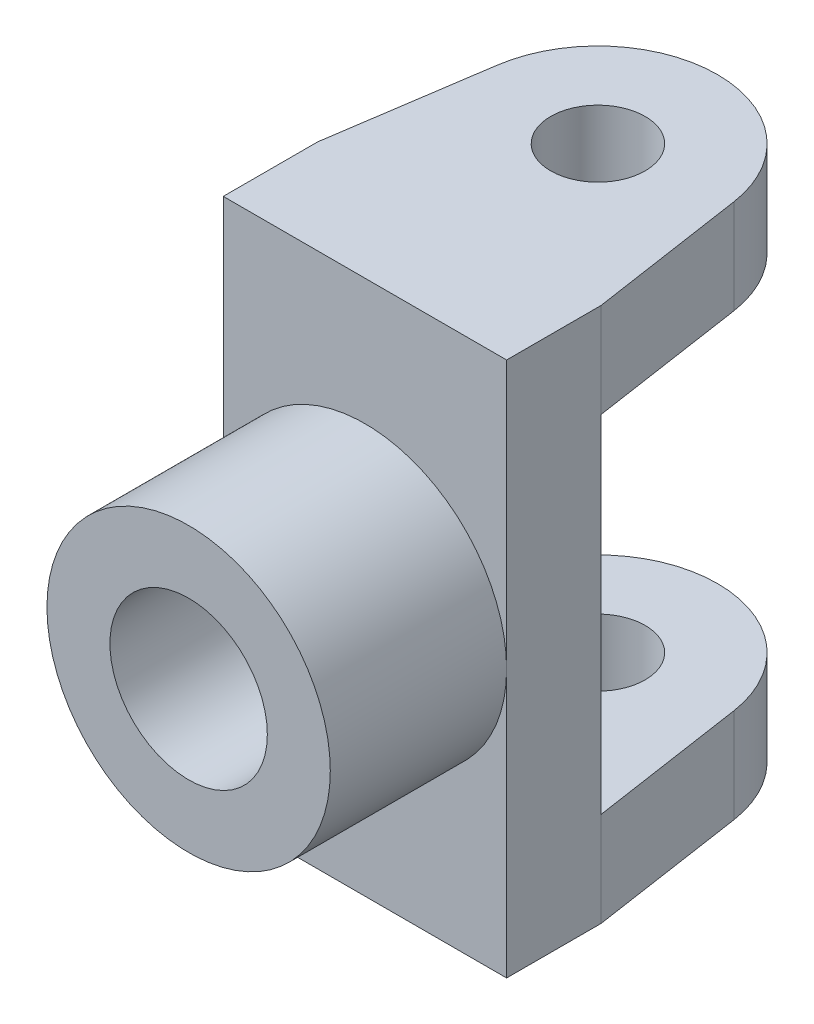
ISO-10303-21;
HEADER;
FILE_DESCRIPTION(('STEP AP214'),'2;1');
FILE_NAME('part.step','',(''),(''),'','','');
FILE_SCHEMA(('AUTOMOTIVE_DESIGN { 1 0 10303 214 1 1 1 1 }'));
ENDSEC;
DATA;
#1=APPLICATION_CONTEXT('core data for automotive mechanical design processes');
#2=APPLICATION_PROTOCOL_DEFINITION('international standard','automotive_design',2000,#1);
#3=PRODUCT_CONTEXT('',#1,'mechanical');
#4=PRODUCT('Part','Part','',(#3));
#5=PRODUCT_RELATED_PRODUCT_CATEGORY('part','',(#4));
#6=PRODUCT_DEFINITION_FORMATION('','',#4);
#7=PRODUCT_DEFINITION_CONTEXT('part definition',#1,'design');
#8=PRODUCT_DEFINITION('design','',#6,#7);
#9=PRODUCT_DEFINITION_SHAPE('','',#8);
#10=(LENGTH_UNIT() NAMED_UNIT(*) SI_UNIT(.MILLI.,.METRE.));
#11=(NAMED_UNIT(*) PLANE_ANGLE_UNIT() SI_UNIT($,.RADIAN.));
#12=(NAMED_UNIT(*) SI_UNIT($,.STERADIAN.) SOLID_ANGLE_UNIT());
#13=UNCERTAINTY_MEASURE_WITH_UNIT(LENGTH_MEASURE(1.E-05),#10,'distance_accuracy_value','');
#14=(GEOMETRIC_REPRESENTATION_CONTEXT(3) GLOBAL_UNCERTAINTY_ASSIGNED_CONTEXT((#13)) GLOBAL_UNIT_ASSIGNED_CONTEXT((#10,
#11,#12)) REPRESENTATION_CONTEXT('',''));
#15=CARTESIAN_POINT('',(0.,0.,0.));
#16=DIRECTION('',(0.,0.,1.));
#17=DIRECTION('',(1.,0.,0.));
#18=AXIS2_PLACEMENT_3D('',#15,#16,#17);
#19=CARTESIAN_POINT('',(0.,0.,0.));
#20=DIRECTION('',(0.,0.,1.));
#21=DIRECTION('',(1.,0.,0.));
#22=AXIS2_PLACEMENT_3D('',#19,#20,#21);
#23=PLANE('',#22);
#24=DIRECTION('',(-1.,0.,0.));
#25=VECTOR('',#24,1.);
#26=CARTESIAN_POINT('',(0.,-55.,0.));
#27=LINE('',#26,#25);
#28=CARTESIAN_POINT('',(45.,-55.,0.));
#29=VERTEX_POINT('',#28);
#30=CARTESIAN_POINT('',(-45.,-55.,0.));
#31=VERTEX_POINT('',#30);
#32=EDGE_CURVE('E137',#29,#31,#27,.T.);
#33=ORIENTED_EDGE('',*,*,#32,.T.);
#34=DIRECTION('',(0.,-1.,0.));
#35=VECTOR('',#34,1.);
#36=CARTESIAN_POINT('',(-45.,85.,0.));
#37=LINE('',#36,#35);
#38=CARTESIAN_POINT('',(-45.,55.,0.));
#39=VERTEX_POINT('',#38);
#40=EDGE_CURVE('E160',#39,#31,#37,.T.);
#41=ORIENTED_EDGE('',*,*,#40,.F.);
#42=DIRECTION('',(-1.,0.,0.));
#43=VECTOR('',#42,1.);
#44=CARTESIAN_POINT('',(0.,55.,0.));
#45=LINE('',#44,#43);
#46=CARTESIAN_POINT('',(45.,55.,0.));
#47=VERTEX_POINT('',#46);
#48=EDGE_CURVE('E151',#47,#39,#45,.T.);
#49=ORIENTED_EDGE('',*,*,#48,.F.);
#50=DIRECTION('',(0.,1.,0.));
#51=VECTOR('',#50,1.);
#52=CARTESIAN_POINT('',(45.,85.,0.));
#53=LINE('',#52,#51);
#54=EDGE_CURVE('E59',#29,#47,#53,.T.);
#55=ORIENTED_EDGE('',*,*,#54,.F.);
#56=EDGE_LOOP('',(#33,#41,#49,#55));
#57=FACE_BOUND('',#56,.T.);
#58=ADVANCED_FACE('F41',(#57),#23,.F.);
#59=CARTESIAN_POINT('',(0.,0.,30.));
#60=DIRECTION('',(0.,0.,1.));
#61=DIRECTION('',(1.,0.,0.));
#62=AXIS2_PLACEMENT_3D('',#59,#60,#61);
#63=PLANE('',#62);
#64=CARTESIAN_POINT('',(0.,0.,30.));
#65=DIRECTION('',(0.,0.,1.));
#66=DIRECTION('',(1.,0.,0.));
#67=AXIS2_PLACEMENT_3D('',#64,#65,#66);
#68=CIRCLE('',#67,45.);
#69=CARTESIAN_POINT('',(45.,0.,30.));
#70=VERTEX_POINT('',#69);
#71=CARTESIAN_POINT('',(-45.,0.,30.));
#72=VERTEX_POINT('',#71);
#73=EDGE_CURVE('E52',#70,#72,#68,.T.);
#74=ORIENTED_EDGE('',*,*,#73,.F.);
#75=DIRECTION('',(0.,1.,0.));
#76=VECTOR('',#75,1.);
#77=CARTESIAN_POINT('',(45.,85.,30.));
#78=LINE('',#77,#76);
#79=CARTESIAN_POINT('',(45.,85.,30.));
#80=VERTEX_POINT('',#79);
#81=EDGE_CURVE('E169',#70,#80,#78,.T.);
#82=ORIENTED_EDGE('',*,*,#81,.T.);
#83=DIRECTION('',(-1.,0.,0.));
#84=VECTOR('',#83,1.);
#85=CARTESIAN_POINT('',(-45.,85.,30.));
#86=LINE('',#85,#84);
#87=CARTESIAN_POINT('',(-45.,85.,30.));
#88=VERTEX_POINT('',#87);
#89=EDGE_CURVE('E192',#80,#88,#86,.T.);
#90=ORIENTED_EDGE('',*,*,#89,.T.);
#91=DIRECTION('',(0.,-1.,0.));
#92=VECTOR('',#91,1.);
#93=CARTESIAN_POINT('',(-45.,85.,30.));
#94=LINE('',#93,#92);
#95=EDGE_CURVE('E242',#88,#72,#94,.T.);
#96=ORIENTED_EDGE('',*,*,#95,.T.);
#97=EDGE_LOOP('',(#74,#82,#90,#96));
#98=FACE_BOUND('',#97,.T.);
#99=ADVANCED_FACE('F261',(#98),#63,.T.);
#100=CARTESIAN_POINT('',(45.,85.,30.));
#101=DIRECTION('',(-1.,0.,0.));
#102=DIRECTION('',(0.,-1.,0.));
#103=AXIS2_PLACEMENT_3D('',#100,#101,#102);
#104=PLANE('',#103);
#105=CARTESIAN_POINT('',(45.,-85.,0.));
#106=VERTEX_POINT('',#105);
#107=EDGE_CURVE('E131',#106,#29,#53,.T.);
#108=ORIENTED_EDGE('',*,*,#107,.T.);
#109=ORIENTED_EDGE('',*,*,#54,.T.);
#110=DIRECTION('',(0.,1.,0.));
#111=VECTOR('',#110,1.);
#112=CARTESIAN_POINT('',(45.,55.,0.));
#113=LINE('',#112,#111);
#114=CARTESIAN_POINT('',(45.,85.,0.));
#115=VERTEX_POINT('',#114);
#116=EDGE_CURVE('E197',#47,#115,#113,.T.);
#117=ORIENTED_EDGE('',*,*,#116,.T.);
#118=DIRECTION('',(0.,0.,-1.));
#119=VECTOR('',#118,1.);
#120=CARTESIAN_POINT('',(45.,85.,30.));
#121=LINE('',#120,#119);
#122=EDGE_CURVE('E45',#80,#115,#121,.T.);
#123=ORIENTED_EDGE('',*,*,#122,.F.);
#124=ORIENTED_EDGE('',*,*,#81,.F.);
#125=CARTESIAN_POINT('',(45.,-85.,30.));
#126=VERTEX_POINT('',#125);
#127=EDGE_CURVE('E237',#126,#70,#78,.T.);
#128=ORIENTED_EDGE('',*,*,#127,.F.);
#129=DIRECTION('',(0.,0.,-1.));
#130=VECTOR('',#129,1.);
#131=CARTESIAN_POINT('',(45.,-85.,30.));
#132=LINE('',#131,#130);
#133=EDGE_CURVE('E158',#126,#106,#132,.T.);
#134=ORIENTED_EDGE('',*,*,#133,.T.);
#135=EDGE_LOOP('',(#108,#109,#117,#123,#124,#128,#134));
#136=FACE_BOUND('',#135,.T.);
#137=ADVANCED_FACE('F43',(#136),#104,.F.);
#138=CARTESIAN_POINT('',(-45.,85.,30.));
#139=DIRECTION('',(0.,-1.,0.));
#140=DIRECTION('',(0.,0.,-1.));
#141=AXIS2_PLACEMENT_3D('',#138,#139,#140);
#142=PLANE('',#141);
#143=ORIENTED_EDGE('',*,*,#122,.T.);
#144=DIRECTION('',(-0.147850805107287,0.,-0.989009676104904));
#145=VECTOR('',#144,1.);
#146=CARTESIAN_POINT('',(44.0163062743107,85.,-6.58016445919533));
#147=LINE('',#146,#145);
#148=CARTESIAN_POINT('',(37.5823676919864,85.,-49.6183305940769));
#149=VERTEX_POINT('',#148);
#150=EDGE_CURVE('E191',#115,#149,#147,.T.);
#151=ORIENTED_EDGE('',*,*,#150,.T.);
#152=CARTESIAN_POINT('',(0.,85.,-44.));
#153=DIRECTION('',(0.,1.,0.));
#154=DIRECTION('',(0.,0.,1.));
#155=AXIS2_PLACEMENT_3D('',#152,#153,#154);
#156=CIRCLE('',#155,38.);
#157=CARTESIAN_POINT('',(-37.5823676919863,85.,-49.618330594077));
#158=VERTEX_POINT('',#157);
#159=EDGE_CURVE('E202',#149,#158,#156,.T.);
#160=ORIENTED_EDGE('',*,*,#159,.T.);
#161=DIRECTION('',(0.147850805107288,0.,-0.989009676104904));
#162=VECTOR('',#161,1.);
#163=CARTESIAN_POINT('',(-44.0163062743107,85.,-6.58016445919539));
#164=LINE('',#163,#162);
#165=CARTESIAN_POINT('',(-45.,85.,0.));
#166=VERTEX_POINT('',#165);
#167=EDGE_CURVE('E207',#166,#158,#164,.T.);
#168=ORIENTED_EDGE('',*,*,#167,.F.);
#169=DIRECTION('',(0.,0.,-1.));
#170=VECTOR('',#169,1.);
#171=CARTESIAN_POINT('',(-45.,85.,30.));
#172=LINE('',#171,#170);
#173=EDGE_CURVE('E175',#88,#166,#172,.T.);
#174=ORIENTED_EDGE('',*,*,#173,.F.);
#175=ORIENTED_EDGE('',*,*,#89,.F.);
#176=EDGE_LOOP('',(#143,#151,#160,#168,#174,#175));
#177=FACE_BOUND('',#176,.T.);
#178=CARTESIAN_POINT('',(0.,85.,-44.));
#179=DIRECTION('',(0.,1.,0.));
#180=DIRECTION('',(0.,0.,1.));
#181=AXIS2_PLACEMENT_3D('',#178,#179,#180);
#182=CIRCLE('',#181,15.);
#183=CARTESIAN_POINT('',(0.,85.,-29.));
#184=VERTEX_POINT('',#183);
#185=EDGE_CURVE('E203',#184,#184,#182,.T.);
#186=ORIENTED_EDGE('',*,*,#185,.F.);
#187=EDGE_LOOP('',(#186));
#188=FACE_BOUND('',#187,.T.);
#189=ADVANCED_FACE('F188',(#177,#188),#142,.F.);
#190=CARTESIAN_POINT('',(-45.,85.,30.));
#191=DIRECTION('',(1.,0.,0.));
#192=DIRECTION('',(0.,1.,0.));
#193=AXIS2_PLACEMENT_3D('',#190,#191,#192);
#194=PLANE('',#193);
#195=EDGE_CURVE('E162',#166,#39,#37,.T.);
#196=ORIENTED_EDGE('',*,*,#195,.T.);
#197=ORIENTED_EDGE('',*,*,#40,.T.);
#198=DIRECTION('',(0.,-1.,0.));
#199=VECTOR('',#198,1.);
#200=CARTESIAN_POINT('',(-45.,-55.,0.));
#201=LINE('',#200,#199);
#202=CARTESIAN_POINT('',(-45.,-85.,0.));
#203=VERTEX_POINT('',#202);
#204=EDGE_CURVE('E254',#31,#203,#201,.T.);
#205=ORIENTED_EDGE('',*,*,#204,.T.);
#206=DIRECTION('',(0.,0.,-1.));
#207=VECTOR('',#206,1.);
#208=CARTESIAN_POINT('',(-45.,-85.,30.));
#209=LINE('',#208,#207);
#210=CARTESIAN_POINT('',(-45.,-85.,30.));
#211=VERTEX_POINT('',#210);
#212=EDGE_CURVE('E172',#211,#203,#209,.T.);
#213=ORIENTED_EDGE('',*,*,#212,.F.);
#214=EDGE_CURVE('E241',#72,#211,#94,.T.);
#215=ORIENTED_EDGE('',*,*,#214,.F.);
#216=ORIENTED_EDGE('',*,*,#95,.F.);
#217=ORIENTED_EDGE('',*,*,#173,.T.);
#218=EDGE_LOOP('',(#196,#197,#205,#213,#215,#216,#217));
#219=FACE_BOUND('',#218,.T.);
#220=ADVANCED_FACE('F253',(#219),#194,.F.);
#221=CARTESIAN_POINT('',(-45.,-85.,30.));
#222=DIRECTION('',(0.,1.,0.));
#223=DIRECTION('',(0.,0.,1.));
#224=AXIS2_PLACEMENT_3D('',#221,#222,#223);
#225=PLANE('',#224);
#226=ORIENTED_EDGE('',*,*,#212,.T.);
#227=DIRECTION('',(0.147850805107288,0.,-0.989009676104904));
#228=VECTOR('',#227,1.);
#229=CARTESIAN_POINT('',(-44.0163062743107,-85.,-6.58016445919539));
#230=LINE('',#229,#228);
#231=CARTESIAN_POINT('',(-37.5823676919863,-85.,-49.618330594077));
#232=VERTEX_POINT('',#231);
#233=EDGE_CURVE('E455',#203,#232,#230,.T.);
#234=ORIENTED_EDGE('',*,*,#233,.T.);
#235=CARTESIAN_POINT('',(0.,-85.,-44.));
#236=DIRECTION('',(0.,1.,0.));
#237=DIRECTION('',(0.,0.,1.));
#238=AXIS2_PLACEMENT_3D('',#235,#236,#237);
#239=CIRCLE('',#238,38.);
#240=CARTESIAN_POINT('',(37.5823676919864,-85.,-49.6183305940769));
#241=VERTEX_POINT('',#240);
#242=EDGE_CURVE('E451',#241,#232,#239,.T.);
#243=ORIENTED_EDGE('',*,*,#242,.F.);
#244=DIRECTION('',(-0.147850805107287,0.,-0.989009676104904));
#245=VECTOR('',#244,1.);
#246=CARTESIAN_POINT('',(44.0163062743107,-85.,-6.58016445919533));
#247=LINE('',#246,#245);
#248=EDGE_CURVE('E259',#106,#241,#247,.T.);
#249=ORIENTED_EDGE('',*,*,#248,.F.);
#250=ORIENTED_EDGE('',*,*,#133,.F.);
#251=DIRECTION('',(1.,0.,0.));
#252=VECTOR('',#251,1.);
#253=CARTESIAN_POINT('',(-45.,-85.,30.));
#254=LINE('',#253,#252);
#255=EDGE_CURVE('E165',#211,#126,#254,.T.);
#256=ORIENTED_EDGE('',*,*,#255,.F.);
#257=EDGE_LOOP('',(#226,#234,#243,#249,#250,#256));
#258=FACE_BOUND('',#257,.T.);
#259=CARTESIAN_POINT('',(0.,-85.,-44.));
#260=DIRECTION('',(0.,1.,0.));
#261=DIRECTION('',(0.,0.,1.));
#262=AXIS2_PLACEMENT_3D('',#259,#260,#261);
#263=CIRCLE('',#262,15.);
#264=CARTESIAN_POINT('',(0.,-85.,-29.));
#265=VERTEX_POINT('',#264);
#266=EDGE_CURVE('E463',#265,#265,#263,.T.);
#267=ORIENTED_EDGE('',*,*,#266,.T.);
#268=EDGE_LOOP('',(#267));
#269=FACE_BOUND('',#268,.T.);
#270=ADVANCED_FACE('F257',(#258,#269),#225,.F.);
#271=EDGE_CURVE('E11',#72,#70,#68,.T.);
#272=ORIENTED_EDGE('',*,*,#271,.F.);
#273=ORIENTED_EDGE('',*,*,#214,.T.);
#274=ORIENTED_EDGE('',*,*,#255,.T.);
#275=ORIENTED_EDGE('',*,*,#127,.T.);
#276=EDGE_LOOP('',(#272,#273,#274,#275));
#277=FACE_BOUND('',#276,.T.);
#278=ADVANCED_FACE('F250',(#277),#63,.T.);
#279=CARTESIAN_POINT('',(0.,0.,86.));
#280=DIRECTION('',(0.,0.,1.));
#281=DIRECTION('',(1.,0.,0.));
#282=AXIS2_PLACEMENT_3D('',#279,#280,#281);
#283=PLANE('',#282);
#284=CARTESIAN_POINT('',(0.,0.,86.));
#285=DIRECTION('',(0.,0.,1.));
#286=DIRECTION('',(1.,0.,0.));
#287=AXIS2_PLACEMENT_3D('',#284,#285,#286);
#288=CIRCLE('',#287,45.);
#289=CARTESIAN_POINT('',(45.,0.,86.));
#290=VERTEX_POINT('',#289);
#291=EDGE_CURVE('E154',#290,#290,#288,.T.);
#292=ORIENTED_EDGE('',*,*,#291,.T.);
#293=EDGE_LOOP('',(#292));
#294=FACE_BOUND('',#293,.T.);
#295=CARTESIAN_POINT('',(0.,0.,86.));
#296=DIRECTION('',(0.,0.,1.));
#297=DIRECTION('',(1.,0.,0.));
#298=AXIS2_PLACEMENT_3D('',#295,#296,#297);
#299=CIRCLE('',#298,25.);
#300=CARTESIAN_POINT('',(25.,0.,86.));
#301=VERTEX_POINT('',#300);
#302=EDGE_CURVE('E225',#301,#301,#299,.T.);
#303=ORIENTED_EDGE('',*,*,#302,.F.);
#304=EDGE_LOOP('',(#303));
#305=FACE_BOUND('',#304,.T.);
#306=ADVANCED_FACE('F266',(#294,#305),#283,.T.);
#307=CARTESIAN_POINT('',(0.,0.,86.));
#308=DIRECTION('',(0.,0.,-1.));
#309=DIRECTION('',(-1.,0.,0.));
#310=AXIS2_PLACEMENT_3D('',#307,#308,#309);
#311=CYLINDRICAL_SURFACE('',#310,45.);
#312=ORIENTED_EDGE('',*,*,#291,.F.);
#313=EDGE_LOOP('',(#312));
#314=FACE_BOUND('',#313,.T.);
#315=ORIENTED_EDGE('',*,*,#73,.T.);
#316=ORIENTED_EDGE('',*,*,#271,.T.);
#317=EDGE_LOOP('',(#315,#316));
#318=FACE_BOUND('',#317,.T.);
#319=ADVANCED_FACE('F263',(#314,#318),#311,.T.);
#320=CARTESIAN_POINT('',(0.,0.,86.));
#321=DIRECTION('',(0.,0.,-1.));
#322=DIRECTION('',(-1.,0.,0.));
#323=AXIS2_PLACEMENT_3D('',#320,#321,#322);
#324=CYLINDRICAL_SURFACE('',#323,25.);
#325=ORIENTED_EDGE('',*,*,#302,.T.);
#326=EDGE_LOOP('',(#325));
#327=FACE_BOUND('',#326,.T.);
#328=CARTESIAN_POINT('',(0.,0.,30.));
#329=DIRECTION('',(0.,0.,1.));
#330=DIRECTION('',(1.,0.,0.));
#331=AXIS2_PLACEMENT_3D('',#328,#329,#330);
#332=CIRCLE('',#331,25.);
#333=CARTESIAN_POINT('',(25.,0.,30.));
#334=VERTEX_POINT('',#333);
#335=EDGE_CURVE('E219',#334,#334,#332,.T.);
#336=ORIENTED_EDGE('',*,*,#335,.F.);
#337=EDGE_LOOP('',(#336));
#338=FACE_BOUND('',#337,.T.);
#339=ADVANCED_FACE('F265',(#327,#338),#324,.F.);
#340=ORIENTED_EDGE('',*,*,#335,.T.);
#341=EDGE_LOOP('',(#340));
#342=FACE_BOUND('',#341,.T.);
#343=ADVANCED_FACE('F273',(#342),#63,.T.);
#344=CARTESIAN_POINT('',(44.0163062743107,55.,-6.58016445919533));
#345=DIRECTION('',(0.989009676104904,0.,-0.147850805107287));
#346=DIRECTION('',(-0.147850805107287,0.,-0.989009676104904));
#347=AXIS2_PLACEMENT_3D('',#344,#345,#346);
#348=PLANE('',#347);
#349=ORIENTED_EDGE('',*,*,#150,.F.);
#350=ORIENTED_EDGE('',*,*,#116,.F.);
#351=DIRECTION('',(-0.147850805107287,0.,-0.989009676104904));
#352=VECTOR('',#351,1.);
#353=CARTESIAN_POINT('',(44.0163062743107,55.,-6.58016445919533));
#354=LINE('',#353,#352);
#355=CARTESIAN_POINT('',(37.5823676919864,55.,-49.6183305940769));
#356=VERTEX_POINT('',#355);
#357=EDGE_CURVE('E481',#47,#356,#354,.T.);
#358=ORIENTED_EDGE('',*,*,#357,.T.);
#359=DIRECTION('',(0.,1.,0.));
#360=VECTOR('',#359,1.);
#361=CARTESIAN_POINT('',(37.5823676919864,55.,-49.6183305940769));
#362=LINE('',#361,#360);
#363=EDGE_CURVE('E199',#356,#149,#362,.T.);
#364=ORIENTED_EDGE('',*,*,#363,.T.);
#365=EDGE_LOOP('',(#349,#350,#358,#364));
#366=FACE_BOUND('',#365,.T.);
#367=ADVANCED_FACE('F195',(#366),#348,.T.);
#368=CARTESIAN_POINT('',(-44.0163062743107,55.,-6.58016445919539));
#369=DIRECTION('',(0.989009676104904,0.,0.147850805107288));
#370=DIRECTION('',(0.147850805107288,0.,-0.989009676104904));
#371=AXIS2_PLACEMENT_3D('',#368,#369,#370);
#372=PLANE('',#371);
#373=ORIENTED_EDGE('',*,*,#167,.T.);
#374=DIRECTION('',(0.,1.,0.));
#375=VECTOR('',#374,1.);
#376=CARTESIAN_POINT('',(-37.5823676919863,55.,-49.618330594077));
#377=LINE('',#376,#375);
#378=CARTESIAN_POINT('',(-37.5823676919863,55.,-49.618330594077));
#379=VERTEX_POINT('',#378);
#380=EDGE_CURVE('E220',#379,#158,#377,.T.);
#381=ORIENTED_EDGE('',*,*,#380,.F.);
#382=DIRECTION('',(0.147850805107288,0.,-0.989009676104904));
#383=VECTOR('',#382,1.);
#384=CARTESIAN_POINT('',(-44.0163062743107,55.,-6.58016445919539));
#385=LINE('',#384,#383);
#386=EDGE_CURVE('E488',#39,#379,#385,.T.);
#387=ORIENTED_EDGE('',*,*,#386,.F.);
#388=ORIENTED_EDGE('',*,*,#195,.F.);
#389=EDGE_LOOP('',(#373,#381,#387,#388));
#390=FACE_BOUND('',#389,.T.);
#391=ADVANCED_FACE('F346',(#390),#372,.F.);
#392=CARTESIAN_POINT('',(0.,55.,-44.));
#393=DIRECTION('',(0.,1.,0.));
#394=DIRECTION('',(0.,0.,1.));
#395=AXIS2_PLACEMENT_3D('',#392,#393,#394);
#396=CYLINDRICAL_SURFACE('',#395,15.);
#397=CARTESIAN_POINT('',(0.,55.,-44.));
#398=DIRECTION('',(0.,1.,0.));
#399=DIRECTION('',(0.,0.,1.));
#400=AXIS2_PLACEMENT_3D('',#397,#398,#399);
#401=CIRCLE('',#400,15.);
#402=CARTESIAN_POINT('',(0.,55.,-29.));
#403=VERTEX_POINT('',#402);
#404=EDGE_CURVE('E216',#403,#403,#401,.T.);
#405=ORIENTED_EDGE('',*,*,#404,.F.);
#406=EDGE_LOOP('',(#405));
#407=FACE_BOUND('',#406,.T.);
#408=ORIENTED_EDGE('',*,*,#185,.T.);
#409=EDGE_LOOP('',(#408));
#410=FACE_BOUND('',#409,.T.);
#411=ADVANCED_FACE('F355',(#407,#410),#396,.F.);
#412=CARTESIAN_POINT('',(0.,55.,-44.));
#413=DIRECTION('',(0.,1.,0.));
#414=DIRECTION('',(0.,0.,1.));
#415=AXIS2_PLACEMENT_3D('',#412,#413,#414);
#416=CYLINDRICAL_SURFACE('',#415,38.);
#417=ORIENTED_EDGE('',*,*,#159,.F.);
#418=ORIENTED_EDGE('',*,*,#363,.F.);
#419=CARTESIAN_POINT('',(0.,55.,-44.));
#420=DIRECTION('',(0.,1.,0.));
#421=DIRECTION('',(0.,0.,1.));
#422=AXIS2_PLACEMENT_3D('',#419,#420,#421);
#423=CIRCLE('',#422,38.);
#424=EDGE_CURVE('E484',#356,#379,#423,.T.);
#425=ORIENTED_EDGE('',*,*,#424,.T.);
#426=ORIENTED_EDGE('',*,*,#380,.T.);
#427=EDGE_LOOP('',(#417,#418,#425,#426));
#428=FACE_BOUND('',#427,.T.);
#429=ADVANCED_FACE('F365',(#428),#416,.T.);
#430=CARTESIAN_POINT('',(0.,55.,0.));
#431=DIRECTION('',(0.,1.,0.));
#432=DIRECTION('',(0.,0.,1.));
#433=AXIS2_PLACEMENT_3D('',#430,#431,#432);
#434=PLANE('',#433);
#435=ORIENTED_EDGE('',*,*,#404,.T.);
#436=EDGE_LOOP('',(#435));
#437=FACE_BOUND('',#436,.T.);
#438=ORIENTED_EDGE('',*,*,#357,.F.);
#439=ORIENTED_EDGE('',*,*,#48,.T.);
#440=ORIENTED_EDGE('',*,*,#386,.T.);
#441=ORIENTED_EDGE('',*,*,#424,.F.);
#442=EDGE_LOOP('',(#438,#439,#440,#441));
#443=FACE_BOUND('',#442,.T.);
#444=ADVANCED_FACE('F375',(#437,#443),#434,.F.);
#445=CARTESIAN_POINT('',(44.0163062743107,-55.,-6.58016445919533));
#446=DIRECTION('',(-0.989009676104904,0.,0.147850805107287));
#447=DIRECTION('',(0.147850805107287,0.,0.989009676104904));
#448=AXIS2_PLACEMENT_3D('',#445,#446,#447);
#449=PLANE('',#448);
#450=ORIENTED_EDGE('',*,*,#248,.T.);
#451=DIRECTION('',(0.,-1.,0.));
#452=VECTOR('',#451,1.);
#453=CARTESIAN_POINT('',(37.5823676919864,-55.,-49.6183305940769));
#454=LINE('',#453,#452);
#455=CARTESIAN_POINT('',(37.5823676919864,-55.,-49.6183305940769));
#456=VERTEX_POINT('',#455);
#457=EDGE_CURVE('E134',#456,#241,#454,.T.);
#458=ORIENTED_EDGE('',*,*,#457,.F.);
#459=DIRECTION('',(-0.147850805107287,0.,-0.989009676104904));
#460=VECTOR('',#459,1.);
#461=CARTESIAN_POINT('',(44.0163062743107,-55.,-6.58016445919533));
#462=LINE('',#461,#460);
#463=EDGE_CURVE('E127',#29,#456,#462,.T.);
#464=ORIENTED_EDGE('',*,*,#463,.F.);
#465=ORIENTED_EDGE('',*,*,#107,.F.);
#466=EDGE_LOOP('',(#450,#458,#464,#465));
#467=FACE_BOUND('',#466,.T.);
#468=ADVANCED_FACE('F130',(#467),#449,.F.);
#469=CARTESIAN_POINT('',(0.,-55.,-44.));
#470=DIRECTION('',(0.,-1.,0.));
#471=DIRECTION('',(0.,0.,-1.));
#472=AXIS2_PLACEMENT_3D('',#469,#470,#471);
#473=CYLINDRICAL_SURFACE('',#472,38.);
#474=ORIENTED_EDGE('',*,*,#242,.T.);
#475=DIRECTION('',(0.,-1.,0.));
#476=VECTOR('',#475,1.);
#477=CARTESIAN_POINT('',(-37.5823676919863,-55.,-49.618330594077));
#478=LINE('',#477,#476);
#479=CARTESIAN_POINT('',(-37.5823676919863,-55.,-49.618330594077));
#480=VERTEX_POINT('',#479);
#481=EDGE_CURVE('E473',#480,#232,#478,.T.);
#482=ORIENTED_EDGE('',*,*,#481,.F.);
#483=CARTESIAN_POINT('',(0.,-55.,-44.));
#484=DIRECTION('',(0.,1.,0.));
#485=DIRECTION('',(0.,0.,1.));
#486=AXIS2_PLACEMENT_3D('',#483,#484,#485);
#487=CIRCLE('',#486,38.);
#488=EDGE_CURVE('E460',#456,#480,#487,.T.);
#489=ORIENTED_EDGE('',*,*,#488,.F.);
#490=ORIENTED_EDGE('',*,*,#457,.T.);
#491=EDGE_LOOP('',(#474,#482,#489,#490));
#492=FACE_BOUND('',#491,.T.);
#493=ADVANCED_FACE('F407',(#492),#473,.T.);
#494=CARTESIAN_POINT('',(-44.0163062743107,-55.,-6.58016445919539));
#495=DIRECTION('',(-0.989009676104904,0.,-0.147850805107288));
#496=DIRECTION('',(-0.147850805107288,0.,0.989009676104904));
#497=AXIS2_PLACEMENT_3D('',#494,#495,#496);
#498=PLANE('',#497);
#499=ORIENTED_EDGE('',*,*,#233,.F.);
#500=ORIENTED_EDGE('',*,*,#204,.F.);
#501=DIRECTION('',(0.147850805107288,0.,-0.989009676104904));
#502=VECTOR('',#501,1.);
#503=CARTESIAN_POINT('',(-44.0163062743107,-55.,-6.58016445919539));
#504=LINE('',#503,#502);
#505=EDGE_CURVE('E144',#31,#480,#504,.T.);
#506=ORIENTED_EDGE('',*,*,#505,.T.);
#507=ORIENTED_EDGE('',*,*,#481,.T.);
#508=EDGE_LOOP('',(#499,#500,#506,#507));
#509=FACE_BOUND('',#508,.T.);
#510=ADVANCED_FACE('F415',(#509),#498,.T.);
#511=CARTESIAN_POINT('',(0.,-55.,-44.));
#512=DIRECTION('',(0.,-1.,0.));
#513=DIRECTION('',(0.,0.,-1.));
#514=AXIS2_PLACEMENT_3D('',#511,#512,#513);
#515=CYLINDRICAL_SURFACE('',#514,15.);
#516=CARTESIAN_POINT('',(0.,-55.,-44.));
#517=DIRECTION('',(0.,1.,0.));
#518=DIRECTION('',(0.,0.,1.));
#519=AXIS2_PLACEMENT_3D('',#516,#517,#518);
#520=CIRCLE('',#519,15.);
#521=CARTESIAN_POINT('',(0.,-55.,-29.));
#522=VERTEX_POINT('',#521);
#523=EDGE_CURVE('E138',#522,#522,#520,.T.);
#524=ORIENTED_EDGE('',*,*,#523,.T.);
#525=EDGE_LOOP('',(#524));
#526=FACE_BOUND('',#525,.T.);
#527=ORIENTED_EDGE('',*,*,#266,.F.);
#528=EDGE_LOOP('',(#527));
#529=FACE_BOUND('',#528,.T.);
#530=ADVANCED_FACE('F424',(#526,#529),#515,.F.);
#531=CARTESIAN_POINT('',(0.,-55.,0.));
#532=DIRECTION('',(0.,-1.,0.));
#533=DIRECTION('',(0.,0.,1.));
#534=AXIS2_PLACEMENT_3D('',#531,#532,#533);
#535=PLANE('',#534);
#536=ORIENTED_EDGE('',*,*,#523,.F.);
#537=EDGE_LOOP('',(#536));
#538=FACE_BOUND('',#537,.T.);
#539=ORIENTED_EDGE('',*,*,#463,.T.);
#540=ORIENTED_EDGE('',*,*,#488,.T.);
#541=ORIENTED_EDGE('',*,*,#505,.F.);
#542=ORIENTED_EDGE('',*,*,#32,.F.);
#543=EDGE_LOOP('',(#539,#540,#541,#542));
#544=FACE_BOUND('',#543,.T.);
#545=ADVANCED_FACE('F142',(#538,#544),#535,.F.);
#546=CLOSED_SHELL('',(#58,#99,#137,#189,#220,#270,#278,#306,#319,#339,#343,#367,#391,#411,#429,
#444,#468,#493,#510,#530,#545));
#547=MANIFOLD_SOLID_BREP('B2',#546);
#548=ADVANCED_BREP_SHAPE_REPRESENTATION('',(#18,#547),#14);
#549=SHAPE_DEFINITION_REPRESENTATION(#9,#548);
ENDSEC;
END-ISO-10303-21;
